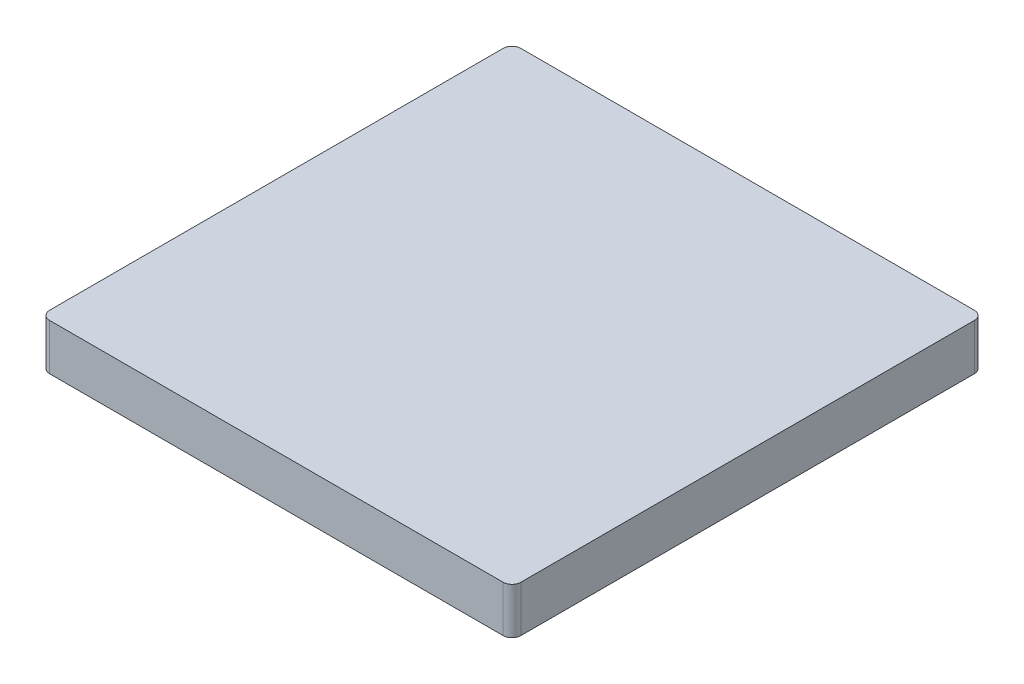
ISO-10303-21;
HEADER;
FILE_DESCRIPTION(('STEP AP214'),'2;1');
FILE_NAME('part.step','',(''),(''),'','','');
FILE_SCHEMA(('AUTOMOTIVE_DESIGN { 1 0 10303 214 1 1 1 1 }'));
ENDSEC;
DATA;
#1=APPLICATION_CONTEXT('core data for automotive mechanical design processes');
#2=APPLICATION_PROTOCOL_DEFINITION('international standard','automotive_design',2000,#1);
#3=PRODUCT_CONTEXT('',#1,'mechanical');
#4=PRODUCT('Part','Part','',(#3));
#5=PRODUCT_RELATED_PRODUCT_CATEGORY('part','',(#4));
#6=PRODUCT_DEFINITION_FORMATION('','',#4);
#7=PRODUCT_DEFINITION_CONTEXT('part definition',#1,'design');
#8=PRODUCT_DEFINITION('design','',#6,#7);
#9=PRODUCT_DEFINITION_SHAPE('','',#8);
#10=(LENGTH_UNIT() NAMED_UNIT(*) SI_UNIT(.MILLI.,.METRE.));
#11=(NAMED_UNIT(*) PLANE_ANGLE_UNIT() SI_UNIT($,.RADIAN.));
#12=(NAMED_UNIT(*) SI_UNIT($,.STERADIAN.) SOLID_ANGLE_UNIT());
#13=UNCERTAINTY_MEASURE_WITH_UNIT(LENGTH_MEASURE(1.E-05),#10,'distance_accuracy_value','');
#14=(GEOMETRIC_REPRESENTATION_CONTEXT(3) GLOBAL_UNCERTAINTY_ASSIGNED_CONTEXT((#13)) GLOBAL_UNIT_ASSIGNED_CONTEXT((#10,
#11,#12)) REPRESENTATION_CONTEXT('',''));
#15=CARTESIAN_POINT('',(0.,0.,0.));
#16=DIRECTION('',(0.,0.,1.));
#17=DIRECTION('',(1.,0.,0.));
#18=AXIS2_PLACEMENT_3D('',#15,#16,#17);
#19=CARTESIAN_POINT('',(8.,1.57,8.));
#20=DIRECTION('',(-1.,0.,0.));
#21=DIRECTION('',(0.,0.,1.));
#22=AXIS2_PLACEMENT_3D('',#19,#20,#21);
#23=PLANE('',#22);
#24=DIRECTION('',(0.,0.,-1.));
#25=VECTOR('',#24,1.);
#26=CARTESIAN_POINT('',(8.,0.,8.));
#27=LINE('',#26,#25);
#28=CARTESIAN_POINT('',(8.,0.,7.7));
#29=VERTEX_POINT('',#28);
#30=CARTESIAN_POINT('',(8.,0.,-7.7));
#31=VERTEX_POINT('',#30);
#32=EDGE_CURVE('E133',#29,#31,#27,.T.);
#33=ORIENTED_EDGE('',*,*,#32,.T.);
#34=DIRECTION('',(0.,-1.,0.));
#35=VECTOR('',#34,1.);
#36=CARTESIAN_POINT('',(8.,1.57,-7.7));
#37=LINE('',#36,#35);
#38=CARTESIAN_POINT('',(8.,1.57,-7.7));
#39=VERTEX_POINT('',#38);
#40=EDGE_CURVE('E156',#31,#39,#37,.F.);
#41=ORIENTED_EDGE('',*,*,#40,.T.);
#42=DIRECTION('',(0.,0.,-1.));
#43=VECTOR('',#42,1.);
#44=CARTESIAN_POINT('',(8.,1.57,8.));
#45=LINE('',#44,#43);
#46=CARTESIAN_POINT('',(8.,1.57,7.7));
#47=VERTEX_POINT('',#46);
#48=EDGE_CURVE('E131',#47,#39,#45,.T.);
#49=ORIENTED_EDGE('',*,*,#48,.F.);
#50=DIRECTION('',(0.,-1.,0.));
#51=VECTOR('',#50,1.);
#52=CARTESIAN_POINT('',(8.,1.57,7.7));
#53=LINE('',#52,#51);
#54=EDGE_CURVE('E153',#47,#29,#53,.T.);
#55=ORIENTED_EDGE('',*,*,#54,.T.);
#56=EDGE_LOOP('',(#33,#41,#49,#55));
#57=FACE_BOUND('',#56,.T.);
#58=ADVANCED_FACE('F38',(#57),#23,.F.);
#59=CARTESIAN_POINT('',(-8.,1.57,-8.));
#60=DIRECTION('',(0.,0.,1.));
#61=DIRECTION('',(1.,0.,0.));
#62=AXIS2_PLACEMENT_3D('',#59,#60,#61);
#63=PLANE('',#62);
#64=DIRECTION('',(-1.,0.,0.));
#65=VECTOR('',#64,1.);
#66=CARTESIAN_POINT('',(-8.,0.,-8.));
#67=LINE('',#66,#65);
#68=CARTESIAN_POINT('',(7.7,0.,-8.));
#69=VERTEX_POINT('',#68);
#70=CARTESIAN_POINT('',(-7.7,0.,-8.));
#71=VERTEX_POINT('',#70);
#72=EDGE_CURVE('E129',#69,#71,#67,.T.);
#73=ORIENTED_EDGE('',*,*,#72,.T.);
#74=DIRECTION('',(0.,-1.,0.));
#75=VECTOR('',#74,1.);
#76=CARTESIAN_POINT('',(-7.7,1.57,-8.));
#77=LINE('',#76,#75);
#78=CARTESIAN_POINT('',(-7.7,1.57,-8.));
#79=VERTEX_POINT('',#78);
#80=EDGE_CURVE('E108',#71,#79,#77,.F.);
#81=ORIENTED_EDGE('',*,*,#80,.T.);
#82=DIRECTION('',(-1.,0.,0.));
#83=VECTOR('',#82,1.);
#84=CARTESIAN_POINT('',(-8.,1.57,-8.));
#85=LINE('',#84,#83);
#86=CARTESIAN_POINT('',(7.7,1.57,-8.));
#87=VERTEX_POINT('',#86);
#88=EDGE_CURVE('E172',#87,#79,#85,.T.);
#89=ORIENTED_EDGE('',*,*,#88,.F.);
#90=DIRECTION('',(0.,-1.,0.));
#91=VECTOR('',#90,1.);
#92=CARTESIAN_POINT('',(7.7,1.57,-8.));
#93=LINE('',#92,#91);
#94=EDGE_CURVE('E113',#87,#69,#93,.T.);
#95=ORIENTED_EDGE('',*,*,#94,.T.);
#96=EDGE_LOOP('',(#73,#81,#89,#95));
#97=FACE_BOUND('',#96,.T.);
#98=ADVANCED_FACE('F189',(#97),#63,.F.);
#99=CARTESIAN_POINT('',(-8.,1.57,8.));
#100=DIRECTION('',(1.,0.,0.));
#101=DIRECTION('',(0.,0.,-1.));
#102=AXIS2_PLACEMENT_3D('',#99,#100,#101);
#103=PLANE('',#102);
#104=DIRECTION('',(0.,0.,1.));
#105=VECTOR('',#104,1.);
#106=CARTESIAN_POINT('',(-8.,1.57,8.));
#107=LINE('',#106,#105);
#108=CARTESIAN_POINT('',(-8.,1.57,-7.7));
#109=VERTEX_POINT('',#108);
#110=CARTESIAN_POINT('',(-8.,1.57,7.7));
#111=VERTEX_POINT('',#110);
#112=EDGE_CURVE('E122',#109,#111,#107,.T.);
#113=ORIENTED_EDGE('',*,*,#112,.F.);
#114=DIRECTION('',(0.,-1.,0.));
#115=VECTOR('',#114,1.);
#116=CARTESIAN_POINT('',(-8.,1.57,-7.7));
#117=LINE('',#116,#115);
#118=CARTESIAN_POINT('',(-8.,0.,-7.7));
#119=VERTEX_POINT('',#118);
#120=EDGE_CURVE('E107',#109,#119,#117,.T.);
#121=ORIENTED_EDGE('',*,*,#120,.T.);
#122=DIRECTION('',(0.,0.,1.));
#123=VECTOR('',#122,1.);
#124=CARTESIAN_POINT('',(-8.,0.,8.));
#125=LINE('',#124,#123);
#126=CARTESIAN_POINT('',(-8.,0.,7.7));
#127=VERTEX_POINT('',#126);
#128=EDGE_CURVE('E120',#119,#127,#125,.T.);
#129=ORIENTED_EDGE('',*,*,#128,.T.);
#130=DIRECTION('',(0.,-1.,0.));
#131=VECTOR('',#130,1.);
#132=CARTESIAN_POINT('',(-8.,1.57,7.7));
#133=LINE('',#132,#131);
#134=EDGE_CURVE('E124',#127,#111,#133,.F.);
#135=ORIENTED_EDGE('',*,*,#134,.T.);
#136=EDGE_LOOP('',(#113,#121,#129,#135));
#137=FACE_BOUND('',#136,.T.);
#138=ADVANCED_FACE('F119',(#137),#103,.F.);
#139=CARTESIAN_POINT('',(-8.,1.57,8.));
#140=DIRECTION('',(0.,0.,-1.));
#141=DIRECTION('',(-1.,0.,0.));
#142=AXIS2_PLACEMENT_3D('',#139,#140,#141);
#143=PLANE('',#142);
#144=DIRECTION('',(1.,0.,0.));
#145=VECTOR('',#144,1.);
#146=CARTESIAN_POINT('',(-8.,0.,8.));
#147=LINE('',#146,#145);
#148=CARTESIAN_POINT('',(-7.7,0.,8.));
#149=VERTEX_POINT('',#148);
#150=CARTESIAN_POINT('',(7.7,0.,8.));
#151=VERTEX_POINT('',#150);
#152=EDGE_CURVE('E128',#149,#151,#147,.T.);
#153=ORIENTED_EDGE('',*,*,#152,.T.);
#154=DIRECTION('',(0.,-1.,0.));
#155=VECTOR('',#154,1.);
#156=CARTESIAN_POINT('',(7.7,1.57,8.));
#157=LINE('',#156,#155);
#158=CARTESIAN_POINT('',(7.7,1.57,8.));
#159=VERTEX_POINT('',#158);
#160=EDGE_CURVE('E11',#151,#159,#157,.F.);
#161=ORIENTED_EDGE('',*,*,#160,.T.);
#162=DIRECTION('',(1.,0.,0.));
#163=VECTOR('',#162,1.);
#164=CARTESIAN_POINT('',(-8.,1.57,8.));
#165=LINE('',#164,#163);
#166=CARTESIAN_POINT('',(-7.7,1.57,8.));
#167=VERTEX_POINT('',#166);
#168=EDGE_CURVE('E137',#167,#159,#165,.T.);
#169=ORIENTED_EDGE('',*,*,#168,.F.);
#170=DIRECTION('',(0.,-1.,0.));
#171=VECTOR('',#170,1.);
#172=CARTESIAN_POINT('',(-7.7,1.57,8.));
#173=LINE('',#172,#171);
#174=EDGE_CURVE('E46',#167,#149,#173,.T.);
#175=ORIENTED_EDGE('',*,*,#174,.T.);
#176=EDGE_LOOP('',(#153,#161,#169,#175));
#177=FACE_BOUND('',#176,.T.);
#178=ADVANCED_FACE('F159',(#177),#143,.F.);
#179=CARTESIAN_POINT('',(0.,1.57,0.));
#180=DIRECTION('',(0.,-1.,0.));
#181=DIRECTION('',(0.,0.,-1.));
#182=AXIS2_PLACEMENT_3D('',#179,#180,#181);
#183=PLANE('',#182);
#184=ORIENTED_EDGE('',*,*,#88,.T.);
#185=CARTESIAN_POINT('',(-7.7,1.57,-7.7));
#186=DIRECTION('',(0.,-1.,0.));
#187=DIRECTION('',(0.,0.,-1.));
#188=AXIS2_PLACEMENT_3D('',#185,#186,#187);
#189=CIRCLE('',#188,0.3);
#190=EDGE_CURVE('E151',#79,#109,#189,.F.);
#191=ORIENTED_EDGE('',*,*,#190,.T.);
#192=ORIENTED_EDGE('',*,*,#112,.T.);
#193=CARTESIAN_POINT('',(-7.7,1.57,7.7));
#194=DIRECTION('',(0.,-1.,0.));
#195=DIRECTION('',(0.,0.,-1.));
#196=AXIS2_PLACEMENT_3D('',#193,#194,#195);
#197=CIRCLE('',#196,0.3);
#198=EDGE_CURVE('E58',#111,#167,#197,.F.);
#199=ORIENTED_EDGE('',*,*,#198,.T.);
#200=ORIENTED_EDGE('',*,*,#168,.T.);
#201=CARTESIAN_POINT('',(7.7,1.57,7.7));
#202=DIRECTION('',(0.,-1.,0.));
#203=DIRECTION('',(0.,0.,-1.));
#204=AXIS2_PLACEMENT_3D('',#201,#202,#203);
#205=CIRCLE('',#204,0.3);
#206=EDGE_CURVE('E147',#159,#47,#205,.F.);
#207=ORIENTED_EDGE('',*,*,#206,.T.);
#208=ORIENTED_EDGE('',*,*,#48,.T.);
#209=CARTESIAN_POINT('',(7.7,1.57,-7.7));
#210=DIRECTION('',(0.,-1.,0.));
#211=DIRECTION('',(0.,0.,-1.));
#212=AXIS2_PLACEMENT_3D('',#209,#210,#211);
#213=CIRCLE('',#212,0.3);
#214=EDGE_CURVE('E149',#39,#87,#213,.F.);
#215=ORIENTED_EDGE('',*,*,#214,.T.);
#216=EDGE_LOOP('',(#184,#191,#192,#199,#200,#207,#208,#215));
#217=FACE_BOUND('',#216,.T.);
#218=ADVANCED_FACE('F178',(#217),#183,.F.);
#219=CARTESIAN_POINT('',(0.,0.,0.));
#220=DIRECTION('',(0.,-1.,0.));
#221=DIRECTION('',(0.,0.,-1.));
#222=AXIS2_PLACEMENT_3D('',#219,#220,#221);
#223=PLANE('',#222);
#224=ORIENTED_EDGE('',*,*,#128,.F.);
#225=CARTESIAN_POINT('',(-7.7,0.,-7.7));
#226=DIRECTION('',(0.,-1.,0.));
#227=DIRECTION('',(0.,0.,-1.));
#228=AXIS2_PLACEMENT_3D('',#225,#226,#227);
#229=CIRCLE('',#228,0.3);
#230=EDGE_CURVE('E103',#119,#71,#229,.T.);
#231=ORIENTED_EDGE('',*,*,#230,.T.);
#232=ORIENTED_EDGE('',*,*,#72,.F.);
#233=CARTESIAN_POINT('',(7.7,0.,-7.7));
#234=DIRECTION('',(0.,-1.,0.));
#235=DIRECTION('',(0.,0.,-1.));
#236=AXIS2_PLACEMENT_3D('',#233,#234,#235);
#237=CIRCLE('',#236,0.3);
#238=EDGE_CURVE('E114',#69,#31,#237,.T.);
#239=ORIENTED_EDGE('',*,*,#238,.T.);
#240=ORIENTED_EDGE('',*,*,#32,.F.);
#241=CARTESIAN_POINT('',(7.7,0.,7.7));
#242=DIRECTION('',(0.,-1.,0.));
#243=DIRECTION('',(0.,0.,-1.));
#244=AXIS2_PLACEMENT_3D('',#241,#242,#243);
#245=CIRCLE('',#244,0.3);
#246=EDGE_CURVE('E140',#29,#151,#245,.T.);
#247=ORIENTED_EDGE('',*,*,#246,.T.);
#248=ORIENTED_EDGE('',*,*,#152,.F.);
#249=CARTESIAN_POINT('',(-7.7,0.,7.7));
#250=DIRECTION('',(0.,-1.,0.));
#251=DIRECTION('',(0.,0.,-1.));
#252=AXIS2_PLACEMENT_3D('',#249,#250,#251);
#253=CIRCLE('',#252,0.3);
#254=EDGE_CURVE('E123',#149,#127,#253,.T.);
#255=ORIENTED_EDGE('',*,*,#254,.T.);
#256=EDGE_LOOP('',(#224,#231,#232,#239,#240,#247,#248,#255));
#257=FACE_BOUND('',#256,.T.);
#258=ADVANCED_FACE('F126',(#257),#223,.T.);
#259=CARTESIAN_POINT('',(-7.7,1.57,-7.7));
#260=DIRECTION('',(0.,-1.,0.));
#261=DIRECTION('',(0.,0.,-1.));
#262=AXIS2_PLACEMENT_3D('',#259,#260,#261);
#263=CYLINDRICAL_SURFACE('',#262,0.3);
#264=ORIENTED_EDGE('',*,*,#190,.F.);
#265=ORIENTED_EDGE('',*,*,#80,.F.);
#266=ORIENTED_EDGE('',*,*,#230,.F.);
#267=ORIENTED_EDGE('',*,*,#120,.F.);
#268=EDGE_LOOP('',(#264,#265,#266,#267));
#269=FACE_BOUND('',#268,.T.);
#270=ADVANCED_FACE('F106',(#269),#263,.T.);
#271=CARTESIAN_POINT('',(7.7,1.57,-7.7));
#272=DIRECTION('',(0.,-1.,0.));
#273=DIRECTION('',(0.,0.,-1.));
#274=AXIS2_PLACEMENT_3D('',#271,#272,#273);
#275=CYLINDRICAL_SURFACE('',#274,0.3);
#276=ORIENTED_EDGE('',*,*,#214,.F.);
#277=ORIENTED_EDGE('',*,*,#40,.F.);
#278=ORIENTED_EDGE('',*,*,#238,.F.);
#279=ORIENTED_EDGE('',*,*,#94,.F.);
#280=EDGE_LOOP('',(#276,#277,#278,#279));
#281=FACE_BOUND('',#280,.T.);
#282=ADVANCED_FACE('F200',(#281),#275,.T.);
#283=CARTESIAN_POINT('',(7.7,1.57,7.7));
#284=DIRECTION('',(0.,-1.,0.));
#285=DIRECTION('',(0.,0.,-1.));
#286=AXIS2_PLACEMENT_3D('',#283,#284,#285);
#287=CYLINDRICAL_SURFACE('',#286,0.3);
#288=ORIENTED_EDGE('',*,*,#206,.F.);
#289=ORIENTED_EDGE('',*,*,#160,.F.);
#290=ORIENTED_EDGE('',*,*,#246,.F.);
#291=ORIENTED_EDGE('',*,*,#54,.F.);
#292=EDGE_LOOP('',(#288,#289,#290,#291));
#293=FACE_BOUND('',#292,.T.);
#294=ADVANCED_FACE('F166',(#293),#287,.T.);
#295=CARTESIAN_POINT('',(-7.7,1.57,7.7));
#296=DIRECTION('',(0.,-1.,0.));
#297=DIRECTION('',(0.,0.,-1.));
#298=AXIS2_PLACEMENT_3D('',#295,#296,#297);
#299=CYLINDRICAL_SURFACE('',#298,0.3);
#300=ORIENTED_EDGE('',*,*,#198,.F.);
#301=ORIENTED_EDGE('',*,*,#134,.F.);
#302=ORIENTED_EDGE('',*,*,#254,.F.);
#303=ORIENTED_EDGE('',*,*,#174,.F.);
#304=EDGE_LOOP('',(#300,#301,#302,#303));
#305=FACE_BOUND('',#304,.T.);
#306=ADVANCED_FACE('F40',(#305),#299,.T.);
#307=CLOSED_SHELL('',(#58,#98,#138,#178,#218,#258,#270,#282,#294,#306));
#308=MANIFOLD_SOLID_BREP('B2',#307);
#309=ADVANCED_BREP_SHAPE_REPRESENTATION('',(#18,#308),#14);
#310=SHAPE_DEFINITION_REPRESENTATION(#9,#309);
ENDSEC;
END-ISO-10303-21;
